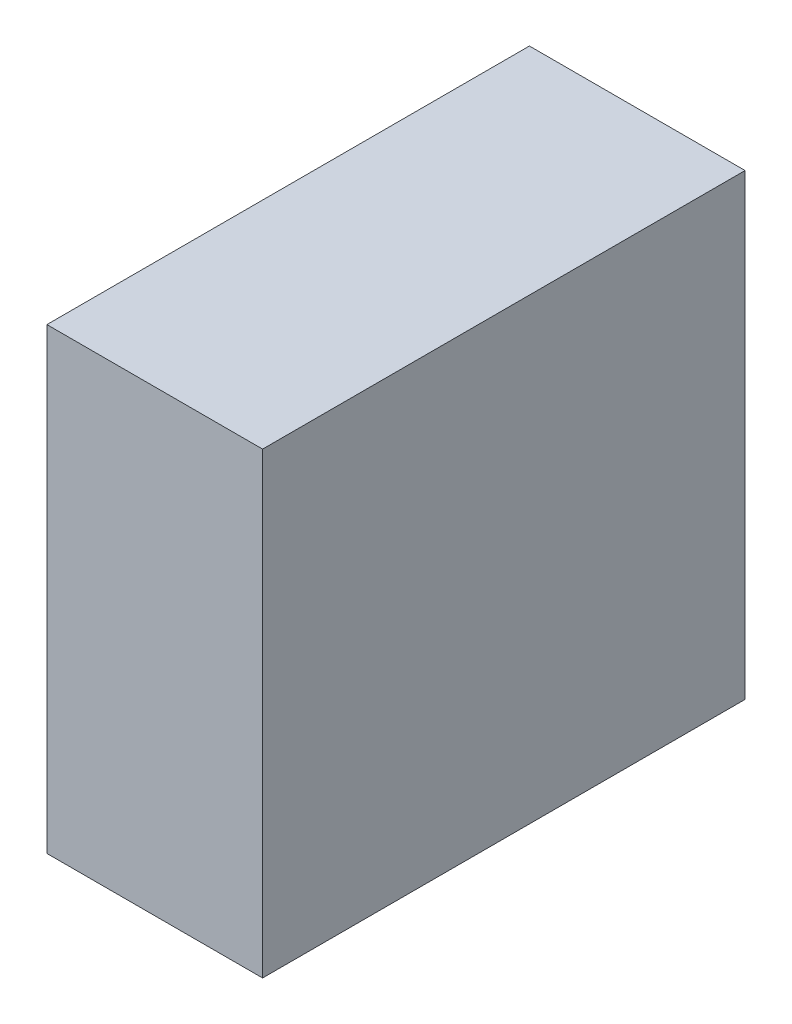
ISO-10303-21;
HEADER;
FILE_DESCRIPTION(('STEP AP214'),'2;1');
FILE_NAME('part.step','',(''),(''),'','','');
FILE_SCHEMA(('AUTOMOTIVE_DESIGN { 1 0 10303 214 1 1 1 1 }'));
ENDSEC;
DATA;
#1=APPLICATION_CONTEXT('core data for automotive mechanical design processes');
#2=APPLICATION_PROTOCOL_DEFINITION('international standard','automotive_design',2000,#1);
#3=PRODUCT_CONTEXT('',#1,'mechanical');
#4=PRODUCT('Part','Part','',(#3));
#5=PRODUCT_RELATED_PRODUCT_CATEGORY('part','',(#4));
#6=PRODUCT_DEFINITION_FORMATION('','',#4);
#7=PRODUCT_DEFINITION_CONTEXT('part definition',#1,'design');
#8=PRODUCT_DEFINITION('design','',#6,#7);
#9=PRODUCT_DEFINITION_SHAPE('','',#8);
#10=(LENGTH_UNIT() NAMED_UNIT(*) SI_UNIT(.MILLI.,.METRE.));
#11=(NAMED_UNIT(*) PLANE_ANGLE_UNIT() SI_UNIT($,.RADIAN.));
#12=(NAMED_UNIT(*) SI_UNIT($,.STERADIAN.) SOLID_ANGLE_UNIT());
#13=UNCERTAINTY_MEASURE_WITH_UNIT(LENGTH_MEASURE(1.E-05),#10,'distance_accuracy_value','');
#14=(GEOMETRIC_REPRESENTATION_CONTEXT(3) GLOBAL_UNCERTAINTY_ASSIGNED_CONTEXT((#13)) GLOBAL_UNIT_ASSIGNED_CONTEXT((#10,
#11,#12)) REPRESENTATION_CONTEXT('',''));
#15=CARTESIAN_POINT('',(0.,0.,0.));
#16=DIRECTION('',(0.,0.,1.));
#17=DIRECTION('',(1.,0.,0.));
#18=AXIS2_PLACEMENT_3D('',#15,#16,#17);
#19=CARTESIAN_POINT('',(2.4250015,-5.14999986,10.85000116));
#20=DIRECTION('',(0.,0.,-1.));
#21=DIRECTION('',(0.,-1.,0.));
#22=AXIS2_PLACEMENT_3D('',#19,#20,#21);
#23=PLANE('',#22);
#24=DIRECTION('',(0.,1.,0.));
#25=VECTOR('',#24,1.);
#26=CARTESIAN_POINT('',(2.4250015,-5.14999986,10.85000116));
#27=LINE('',#26,#25);
#28=CARTESIAN_POINT('',(2.4250015,-5.14999986,10.85000116));
#29=VERTEX_POINT('',#28);
#30=CARTESIAN_POINT('',(2.4250015,5.14999986,10.85000116));
#31=VERTEX_POINT('',#30);
#32=EDGE_CURVE('E94',#29,#31,#27,.T.);
#33=ORIENTED_EDGE('',*,*,#32,.T.);
#34=DIRECTION('',(-1.,0.,0.));
#35=VECTOR('',#34,1.);
#36=CARTESIAN_POINT('',(2.4250015,5.14999986,10.85000116));
#37=LINE('',#36,#35);
#38=CARTESIAN_POINT('',(-2.42499896,5.14999986,10.85000116));
#39=VERTEX_POINT('',#38);
#40=EDGE_CURVE('E75',#31,#39,#37,.T.);
#41=ORIENTED_EDGE('',*,*,#40,.T.);
#42=DIRECTION('',(0.,-1.,0.));
#43=VECTOR('',#42,1.);
#44=CARTESIAN_POINT('',(-2.42499896,5.14999986,10.85000116));
#45=LINE('',#44,#43);
#46=CARTESIAN_POINT('',(-2.42499896,-5.14999986,10.85000116));
#47=VERTEX_POINT('',#46);
#48=EDGE_CURVE('E78',#39,#47,#45,.T.);
#49=ORIENTED_EDGE('',*,*,#48,.T.);
#50=DIRECTION('',(1.,0.,0.));
#51=VECTOR('',#50,1.);
#52=CARTESIAN_POINT('',(-2.42499896,-5.14999986,10.85000116));
#53=LINE('',#52,#51);
#54=EDGE_CURVE('E10',#47,#29,#53,.T.);
#55=ORIENTED_EDGE('',*,*,#54,.T.);
#56=EDGE_LOOP('',(#33,#41,#49,#55));
#57=FACE_BOUND('',#56,.T.);
#58=ADVANCED_FACE('F16',(#57),#23,.F.);
#59=CARTESIAN_POINT('',(2.4250015,-5.14999986,0.));
#60=DIRECTION('',(0.,0.,-1.));
#61=DIRECTION('',(0.,-1.,0.));
#62=AXIS2_PLACEMENT_3D('',#59,#60,#61);
#63=PLANE('',#62);
#64=DIRECTION('',(1.,0.,0.));
#65=VECTOR('',#64,1.);
#66=CARTESIAN_POINT('',(-2.42499896,-5.14999986,0.));
#67=LINE('',#66,#65);
#68=CARTESIAN_POINT('',(-2.42499896,-5.14999986,0.));
#69=VERTEX_POINT('',#68);
#70=CARTESIAN_POINT('',(2.4250015,-5.14999986,0.));
#71=VERTEX_POINT('',#70);
#72=EDGE_CURVE('E27',#69,#71,#67,.T.);
#73=ORIENTED_EDGE('',*,*,#72,.F.);
#74=DIRECTION('',(0.,-1.,0.));
#75=VECTOR('',#74,1.);
#76=CARTESIAN_POINT('',(-2.42499896,5.14999986,0.));
#77=LINE('',#76,#75);
#78=CARTESIAN_POINT('',(-2.42499896,5.14999986,0.));
#79=VERTEX_POINT('',#78);
#80=EDGE_CURVE('E64',#79,#69,#77,.T.);
#81=ORIENTED_EDGE('',*,*,#80,.F.);
#82=DIRECTION('',(-1.,0.,0.));
#83=VECTOR('',#82,1.);
#84=CARTESIAN_POINT('',(2.4250015,5.14999986,0.));
#85=LINE('',#84,#83);
#86=CARTESIAN_POINT('',(2.4250015,5.14999986,0.));
#87=VERTEX_POINT('',#86);
#88=EDGE_CURVE('E69',#87,#79,#85,.T.);
#89=ORIENTED_EDGE('',*,*,#88,.F.);
#90=DIRECTION('',(0.,1.,0.));
#91=VECTOR('',#90,1.);
#92=CARTESIAN_POINT('',(2.4250015,-5.14999986,0.));
#93=LINE('',#92,#91);
#94=EDGE_CURVE('E104',#71,#87,#93,.T.);
#95=ORIENTED_EDGE('',*,*,#94,.F.);
#96=EDGE_LOOP('',(#73,#81,#89,#95));
#97=FACE_BOUND('',#96,.T.);
#98=ADVANCED_FACE('F66',(#97),#63,.T.);
#99=CARTESIAN_POINT('',(-2.42499896,-5.14999986,0.));
#100=DIRECTION('',(0.,1.,0.));
#101=DIRECTION('',(1.,0.,0.));
#102=AXIS2_PLACEMENT_3D('',#99,#100,#101);
#103=PLANE('',#102);
#104=ORIENTED_EDGE('',*,*,#72,.T.);
#105=DIRECTION('',(0.,0.,1.));
#106=VECTOR('',#105,1.);
#107=CARTESIAN_POINT('',(2.4250015,-5.14999986,0.));
#108=LINE('',#107,#106);
#109=EDGE_CURVE('E88',#71,#29,#108,.T.);
#110=ORIENTED_EDGE('',*,*,#109,.T.);
#111=ORIENTED_EDGE('',*,*,#54,.F.);
#112=DIRECTION('',(0.,0.,1.));
#113=VECTOR('',#112,1.);
#114=CARTESIAN_POINT('',(-2.42499896,-5.14999986,0.));
#115=LINE('',#114,#113);
#116=EDGE_CURVE('E74',#69,#47,#115,.T.);
#117=ORIENTED_EDGE('',*,*,#116,.F.);
#118=EDGE_LOOP('',(#104,#110,#111,#117));
#119=FACE_BOUND('',#118,.T.);
#120=ADVANCED_FACE('F113',(#119),#103,.F.);
#121=CARTESIAN_POINT('',(-2.42499896,5.14999986,0.));
#122=DIRECTION('',(1.,0.,0.));
#123=DIRECTION('',(0.,1.,0.));
#124=AXIS2_PLACEMENT_3D('',#121,#122,#123);
#125=PLANE('',#124);
#126=ORIENTED_EDGE('',*,*,#80,.T.);
#127=ORIENTED_EDGE('',*,*,#116,.T.);
#128=ORIENTED_EDGE('',*,*,#48,.F.);
#129=DIRECTION('',(0.,0.,1.));
#130=VECTOR('',#129,1.);
#131=CARTESIAN_POINT('',(-2.42499896,5.14999986,0.));
#132=LINE('',#131,#130);
#133=EDGE_CURVE('E77',#79,#39,#132,.T.);
#134=ORIENTED_EDGE('',*,*,#133,.F.);
#135=EDGE_LOOP('',(#126,#127,#128,#134));
#136=FACE_BOUND('',#135,.T.);
#137=ADVANCED_FACE('F18',(#136),#125,.F.);
#138=CARTESIAN_POINT('',(2.4250015,5.14999986,0.));
#139=DIRECTION('',(0.,-1.,0.));
#140=DIRECTION('',(0.,0.,-1.));
#141=AXIS2_PLACEMENT_3D('',#138,#139,#140);
#142=PLANE('',#141);
#143=ORIENTED_EDGE('',*,*,#88,.T.);
#144=ORIENTED_EDGE('',*,*,#133,.T.);
#145=ORIENTED_EDGE('',*,*,#40,.F.);
#146=DIRECTION('',(0.,0.,1.));
#147=VECTOR('',#146,1.);
#148=CARTESIAN_POINT('',(2.4250015,5.14999986,0.));
#149=LINE('',#148,#147);
#150=EDGE_CURVE('E20',#87,#31,#149,.T.);
#151=ORIENTED_EDGE('',*,*,#150,.F.);
#152=EDGE_LOOP('',(#143,#144,#145,#151));
#153=FACE_BOUND('',#152,.T.);
#154=ADVANCED_FACE('F84',(#153),#142,.F.);
#155=CARTESIAN_POINT('',(2.4250015,-5.14999986,0.));
#156=DIRECTION('',(-1.,0.,0.));
#157=DIRECTION('',(0.,0.,1.));
#158=AXIS2_PLACEMENT_3D('',#155,#156,#157);
#159=PLANE('',#158);
#160=ORIENTED_EDGE('',*,*,#94,.T.);
#161=ORIENTED_EDGE('',*,*,#150,.T.);
#162=ORIENTED_EDGE('',*,*,#32,.F.);
#163=ORIENTED_EDGE('',*,*,#109,.F.);
#164=EDGE_LOOP('',(#160,#161,#162,#163));
#165=FACE_BOUND('',#164,.T.);
#166=ADVANCED_FACE('F117',(#165),#159,.F.);
#167=CLOSED_SHELL('',(#58,#98,#120,#137,#154,#166));
#168=MANIFOLD_SOLID_BREP('B1',#167);
#169=ADVANCED_BREP_SHAPE_REPRESENTATION('',(#18,#168),#14);
#170=SHAPE_DEFINITION_REPRESENTATION(#9,#169);
ENDSEC;
END-ISO-10303-21;
